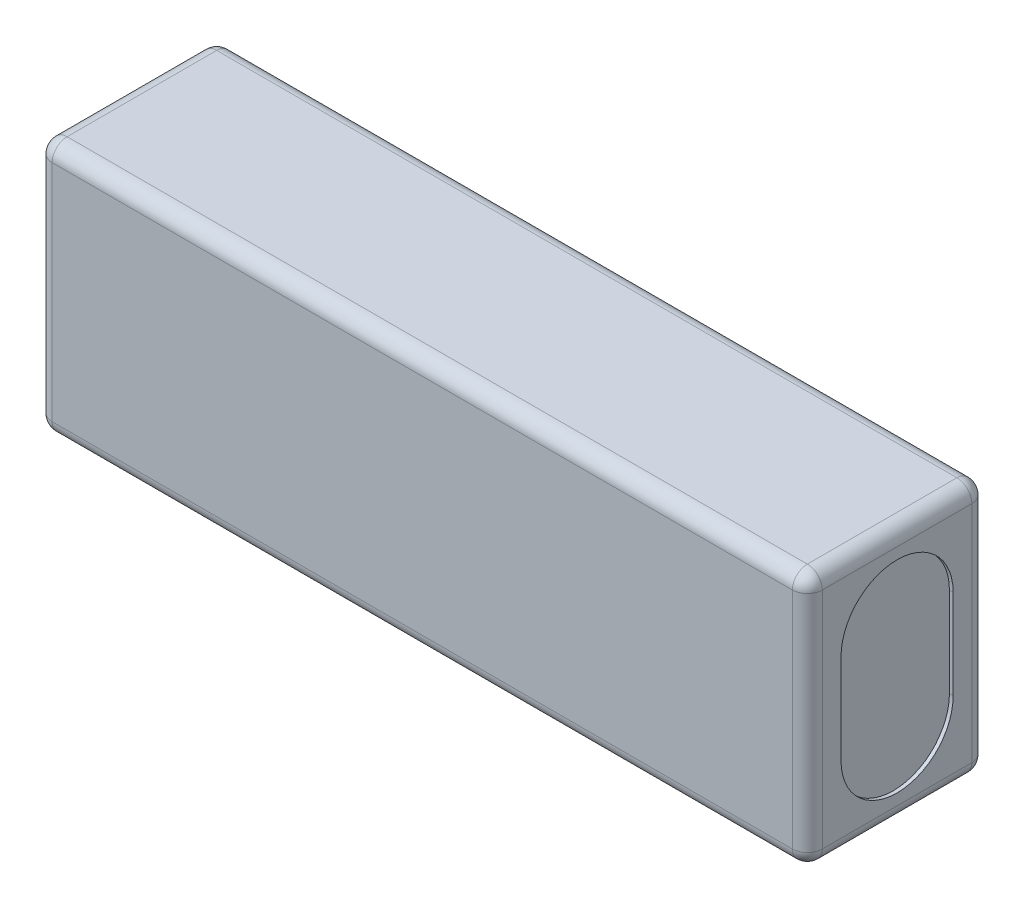
ISO-10303-21;
HEADER;
FILE_DESCRIPTION(('STEP AP214'),'2;1');
FILE_NAME('part.step','',(''),(''),'','','');
FILE_SCHEMA(('AUTOMOTIVE_DESIGN { 1 0 10303 214 1 1 1 1 }'));
ENDSEC;
DATA;
#1=APPLICATION_CONTEXT('core data for automotive mechanical design processes');
#2=APPLICATION_PROTOCOL_DEFINITION('international standard','automotive_design',2000,#1);
#3=PRODUCT_CONTEXT('',#1,'mechanical');
#4=PRODUCT('Part','Part','',(#3));
#5=PRODUCT_RELATED_PRODUCT_CATEGORY('part','',(#4));
#6=PRODUCT_DEFINITION_FORMATION('','',#4);
#7=PRODUCT_DEFINITION_CONTEXT('part definition',#1,'design');
#8=PRODUCT_DEFINITION('design','',#6,#7);
#9=PRODUCT_DEFINITION_SHAPE('','',#8);
#10=(LENGTH_UNIT() NAMED_UNIT(*) SI_UNIT(.MILLI.,.METRE.));
#11=(NAMED_UNIT(*) PLANE_ANGLE_UNIT() SI_UNIT($,.RADIAN.));
#12=(NAMED_UNIT(*) SI_UNIT($,.STERADIAN.) SOLID_ANGLE_UNIT());
#13=UNCERTAINTY_MEASURE_WITH_UNIT(LENGTH_MEASURE(1.E-05),#10,'distance_accuracy_value','');
#14=(GEOMETRIC_REPRESENTATION_CONTEXT(3) GLOBAL_UNCERTAINTY_ASSIGNED_CONTEXT((#13)) GLOBAL_UNIT_ASSIGNED_CONTEXT((#10,
#11,#12)) REPRESENTATION_CONTEXT('',''));
#15=CARTESIAN_POINT('',(0.,0.,0.));
#16=DIRECTION('',(0.,0.,1.));
#17=DIRECTION('',(1.,0.,0.));
#18=AXIS2_PLACEMENT_3D('',#15,#16,#17);
#19=CARTESIAN_POINT('',(-51.5,17.,24.));
#20=DIRECTION('',(1.,0.,0.));
#21=DIRECTION('',(0.,1.,0.));
#22=AXIS2_PLACEMENT_3D('',#19,#20,#21);
#23=PLANE('',#22);
#24=DIRECTION('',(0.,-1.,0.));
#25=VECTOR('',#24,1.);
#26=CARTESIAN_POINT('',(-51.5,17.,2.));
#27=LINE('',#26,#25);
#28=CARTESIAN_POINT('',(-51.5,15.,2.));
#29=VERTEX_POINT('',#28);
#30=CARTESIAN_POINT('',(-51.5,-15.,2.));
#31=VERTEX_POINT('',#30);
#32=EDGE_CURVE('E258',#29,#31,#27,.T.);
#33=ORIENTED_EDGE('',*,*,#32,.T.);
#34=DIRECTION('',(0.,0.,-1.));
#35=VECTOR('',#34,1.);
#36=CARTESIAN_POINT('',(-51.5,-15.,24.));
#37=LINE('',#36,#35);
#38=CARTESIAN_POINT('',(-51.5,-15.,22.));
#39=VERTEX_POINT('',#38);
#40=EDGE_CURVE('E260',#31,#39,#37,.F.);
#41=ORIENTED_EDGE('',*,*,#40,.T.);
#42=DIRECTION('',(0.,-1.,0.));
#43=VECTOR('',#42,1.);
#44=CARTESIAN_POINT('',(-51.5,17.,22.));
#45=LINE('',#44,#43);
#46=CARTESIAN_POINT('',(-51.5,15.,22.));
#47=VERTEX_POINT('',#46);
#48=EDGE_CURVE('E254',#39,#47,#45,.F.);
#49=ORIENTED_EDGE('',*,*,#48,.T.);
#50=DIRECTION('',(0.,0.,-1.));
#51=VECTOR('',#50,1.);
#52=CARTESIAN_POINT('',(-51.5,15.,24.));
#53=LINE('',#52,#51);
#54=EDGE_CURVE('E256',#47,#29,#53,.T.);
#55=ORIENTED_EDGE('',*,*,#54,.T.);
#56=EDGE_LOOP('',(#33,#41,#49,#55));
#57=FACE_BOUND('',#56,.T.);
#58=CARTESIAN_POINT('',(-51.5,6.,12.));
#59=DIRECTION('',(1.,0.,0.));
#60=DIRECTION('',(0.,1.,0.));
#61=AXIS2_PLACEMENT_3D('',#58,#59,#60);
#62=CIRCLE('',#61,7.5);
#63=CARTESIAN_POINT('',(-51.5,6.00000000000001,4.5));
#64=VERTEX_POINT('',#63);
#65=CARTESIAN_POINT('',(-51.5,6.,19.5));
#66=VERTEX_POINT('',#65);
#67=EDGE_CURVE('E191',#64,#66,#62,.T.);
#68=ORIENTED_EDGE('',*,*,#67,.T.);
#69=DIRECTION('',(0.,-1.,0.));
#70=VECTOR('',#69,1.);
#71=CARTESIAN_POINT('',(-51.5,6.,19.5));
#72=LINE('',#71,#70);
#73=CARTESIAN_POINT('',(-51.5,-6.,19.5));
#74=VERTEX_POINT('',#73);
#75=EDGE_CURVE('E195',#66,#74,#72,.T.);
#76=ORIENTED_EDGE('',*,*,#75,.T.);
#77=CARTESIAN_POINT('',(-51.5,-6.,12.));
#78=DIRECTION('',(1.,0.,0.));
#79=DIRECTION('',(0.,1.,0.));
#80=AXIS2_PLACEMENT_3D('',#77,#78,#79);
#81=CIRCLE('',#80,7.5);
#82=CARTESIAN_POINT('',(-51.5,-6.,4.5));
#83=VERTEX_POINT('',#82);
#84=EDGE_CURVE('E198',#74,#83,#81,.T.);
#85=ORIENTED_EDGE('',*,*,#84,.T.);
#86=DIRECTION('',(0.,1.,0.));
#87=VECTOR('',#86,1.);
#88=CARTESIAN_POINT('',(-51.5,6.00000000000001,4.5));
#89=LINE('',#88,#87);
#90=EDGE_CURVE('E204',#83,#64,#89,.T.);
#91=ORIENTED_EDGE('',*,*,#90,.T.);
#92=EDGE_LOOP('',(#68,#76,#85,#91));
#93=FACE_BOUND('',#92,.T.);
#94=ADVANCED_FACE('F34',(#57,#93),#23,.F.);
#95=CARTESIAN_POINT('',(51.5,17.,24.));
#96=DIRECTION('',(-1.,0.,0.));
#97=DIRECTION('',(0.,-1.,0.));
#98=AXIS2_PLACEMENT_3D('',#95,#96,#97);
#99=PLANE('',#98);
#100=DIRECTION('',(0.,1.,0.));
#101=VECTOR('',#100,1.);
#102=CARTESIAN_POINT('',(51.5,-17.,22.));
#103=LINE('',#102,#101);
#104=CARTESIAN_POINT('',(51.5,15.,22.));
#105=VERTEX_POINT('',#104);
#106=CARTESIAN_POINT('',(51.5,-15.,22.));
#107=VERTEX_POINT('',#106);
#108=EDGE_CURVE('E263',#105,#107,#103,.F.);
#109=ORIENTED_EDGE('',*,*,#108,.T.);
#110=DIRECTION('',(0.,0.,-1.));
#111=VECTOR('',#110,1.);
#112=CARTESIAN_POINT('',(51.5,-15.,24.));
#113=LINE('',#112,#111);
#114=CARTESIAN_POINT('',(51.5,-15.,2.));
#115=VERTEX_POINT('',#114);
#116=EDGE_CURVE('E269',#107,#115,#113,.T.);
#117=ORIENTED_EDGE('',*,*,#116,.T.);
#118=DIRECTION('',(0.,1.,0.));
#119=VECTOR('',#118,1.);
#120=CARTESIAN_POINT('',(51.5,17.,2.));
#121=LINE('',#120,#119);
#122=CARTESIAN_POINT('',(51.5,15.,2.));
#123=VERTEX_POINT('',#122);
#124=EDGE_CURVE('E267',#115,#123,#121,.T.);
#125=ORIENTED_EDGE('',*,*,#124,.T.);
#126=DIRECTION('',(0.,0.,-1.));
#127=VECTOR('',#126,1.);
#128=CARTESIAN_POINT('',(51.5,15.,24.));
#129=LINE('',#128,#127);
#130=EDGE_CURVE('E265',#123,#105,#129,.F.);
#131=ORIENTED_EDGE('',*,*,#130,.T.);
#132=EDGE_LOOP('',(#109,#117,#125,#131));
#133=FACE_BOUND('',#132,.T.);
#134=DIRECTION('',(0.,-1.,0.));
#135=VECTOR('',#134,1.);
#136=CARTESIAN_POINT('',(51.5,6.,19.5));
#137=LINE('',#136,#135);
#138=CARTESIAN_POINT('',(51.5,6.,19.5));
#139=VERTEX_POINT('',#138);
#140=CARTESIAN_POINT('',(51.5,-6.,19.5));
#141=VERTEX_POINT('',#140);
#142=EDGE_CURVE('E229',#139,#141,#137,.T.);
#143=ORIENTED_EDGE('',*,*,#142,.F.);
#144=CARTESIAN_POINT('',(51.5,6.,12.));
#145=DIRECTION('',(1.,0.,0.));
#146=DIRECTION('',(0.,1.,0.));
#147=AXIS2_PLACEMENT_3D('',#144,#145,#146);
#148=CIRCLE('',#147,7.5);
#149=CARTESIAN_POINT('',(51.5,6.00000000000001,4.5));
#150=VERTEX_POINT('',#149);
#151=EDGE_CURVE('E210',#150,#139,#148,.T.);
#152=ORIENTED_EDGE('',*,*,#151,.F.);
#153=DIRECTION('',(0.,1.,0.));
#154=VECTOR('',#153,1.);
#155=CARTESIAN_POINT('',(51.5,6.00000000000001,4.5));
#156=LINE('',#155,#154);
#157=CARTESIAN_POINT('',(51.5,-6.,4.5));
#158=VERTEX_POINT('',#157);
#159=EDGE_CURVE('E218',#158,#150,#156,.T.);
#160=ORIENTED_EDGE('',*,*,#159,.F.);
#161=CARTESIAN_POINT('',(51.5,-6.,12.));
#162=DIRECTION('',(1.,0.,0.));
#163=DIRECTION('',(0.,1.,0.));
#164=AXIS2_PLACEMENT_3D('',#161,#162,#163);
#165=CIRCLE('',#164,7.5);
#166=EDGE_CURVE('E232',#141,#158,#165,.T.);
#167=ORIENTED_EDGE('',*,*,#166,.F.);
#168=EDGE_LOOP('',(#143,#152,#160,#167));
#169=FACE_BOUND('',#168,.T.);
#170=ADVANCED_FACE('F397',(#133,#169),#99,.F.);
#171=CARTESIAN_POINT('',(-51.5,17.,24.));
#172=DIRECTION('',(0.,-1.,0.));
#173=DIRECTION('',(0.,0.,-1.));
#174=AXIS2_PLACEMENT_3D('',#171,#172,#173);
#175=PLANE('',#174);
#176=DIRECTION('',(0.,0.,-1.));
#177=VECTOR('',#176,1.);
#178=CARTESIAN_POINT('',(49.5,17.,24.));
#179=LINE('',#178,#177);
#180=CARTESIAN_POINT('',(49.5,17.,22.));
#181=VERTEX_POINT('',#180);
#182=CARTESIAN_POINT('',(49.5,17.,2.));
#183=VERTEX_POINT('',#182);
#184=EDGE_CURVE('E285',#181,#183,#179,.T.);
#185=ORIENTED_EDGE('',*,*,#184,.T.);
#186=DIRECTION('',(-1.,0.,0.));
#187=VECTOR('',#186,1.);
#188=CARTESIAN_POINT('',(-51.5,17.,2.));
#189=LINE('',#188,#187);
#190=CARTESIAN_POINT('',(-49.5,17.,2.));
#191=VERTEX_POINT('',#190);
#192=EDGE_CURVE('E288',#183,#191,#189,.T.);
#193=ORIENTED_EDGE('',*,*,#192,.T.);
#194=DIRECTION('',(0.,0.,-1.));
#195=VECTOR('',#194,1.);
#196=CARTESIAN_POINT('',(-49.5,17.,24.));
#197=LINE('',#196,#195);
#198=CARTESIAN_POINT('',(-49.5,17.,22.));
#199=VERTEX_POINT('',#198);
#200=EDGE_CURVE('E283',#191,#199,#197,.F.);
#201=ORIENTED_EDGE('',*,*,#200,.T.);
#202=DIRECTION('',(-1.,0.,0.));
#203=VECTOR('',#202,1.);
#204=CARTESIAN_POINT('',(51.5,17.,22.));
#205=LINE('',#204,#203);
#206=EDGE_CURVE('E281',#199,#181,#205,.F.);
#207=ORIENTED_EDGE('',*,*,#206,.T.);
#208=EDGE_LOOP('',(#185,#193,#201,#207));
#209=FACE_BOUND('',#208,.T.);
#210=ADVANCED_FACE('F412',(#209),#175,.F.);
#211=CARTESIAN_POINT('',(-51.5,-17.,24.));
#212=DIRECTION('',(0.,1.,0.));
#213=DIRECTION('',(0.,0.,1.));
#214=AXIS2_PLACEMENT_3D('',#211,#212,#213);
#215=PLANE('',#214);
#216=DIRECTION('',(0.,0.,-1.));
#217=VECTOR('',#216,1.);
#218=CARTESIAN_POINT('',(-49.5,-17.,24.));
#219=LINE('',#218,#217);
#220=CARTESIAN_POINT('',(-49.5,-17.,22.));
#221=VERTEX_POINT('',#220);
#222=CARTESIAN_POINT('',(-49.5,-17.,2.));
#223=VERTEX_POINT('',#222);
#224=EDGE_CURVE('E249',#221,#223,#219,.T.);
#225=ORIENTED_EDGE('',*,*,#224,.T.);
#226=DIRECTION('',(1.,0.,0.));
#227=VECTOR('',#226,1.);
#228=CARTESIAN_POINT('',(-51.5,-17.,2.));
#229=LINE('',#228,#227);
#230=CARTESIAN_POINT('',(49.5,-17.,2.));
#231=VERTEX_POINT('',#230);
#232=EDGE_CURVE('E252',#223,#231,#229,.T.);
#233=ORIENTED_EDGE('',*,*,#232,.T.);
#234=DIRECTION('',(0.,0.,-1.));
#235=VECTOR('',#234,1.);
#236=CARTESIAN_POINT('',(49.5,-17.,24.));
#237=LINE('',#236,#235);
#238=CARTESIAN_POINT('',(49.5,-17.,22.));
#239=VERTEX_POINT('',#238);
#240=EDGE_CURVE('E247',#231,#239,#237,.F.);
#241=ORIENTED_EDGE('',*,*,#240,.T.);
#242=DIRECTION('',(1.,0.,0.));
#243=VECTOR('',#242,1.);
#244=CARTESIAN_POINT('',(-51.5,-17.,22.));
#245=LINE('',#244,#243);
#246=EDGE_CURVE('E239',#239,#221,#245,.F.);
#247=ORIENTED_EDGE('',*,*,#246,.T.);
#248=EDGE_LOOP('',(#225,#233,#241,#247));
#249=FACE_BOUND('',#248,.T.);
#250=ADVANCED_FACE('F444',(#249),#215,.F.);
#251=CARTESIAN_POINT('',(0.,0.,24.));
#252=DIRECTION('',(0.,0.,1.));
#253=DIRECTION('',(1.,0.,0.));
#254=AXIS2_PLACEMENT_3D('',#251,#252,#253);
#255=PLANE('',#254);
#256=DIRECTION('',(0.,-1.,0.));
#257=VECTOR('',#256,1.);
#258=CARTESIAN_POINT('',(-49.5,-17.,24.));
#259=LINE('',#258,#257);
#260=CARTESIAN_POINT('',(-49.5,15.,24.));
#261=VERTEX_POINT('',#260);
#262=CARTESIAN_POINT('',(-49.5,-15.,24.));
#263=VERTEX_POINT('',#262);
#264=EDGE_CURVE('E43',#261,#263,#259,.T.);
#265=ORIENTED_EDGE('',*,*,#264,.T.);
#266=DIRECTION('',(1.,0.,0.));
#267=VECTOR('',#266,1.);
#268=CARTESIAN_POINT('',(51.5,-15.,24.));
#269=LINE('',#268,#267);
#270=CARTESIAN_POINT('',(49.5,-15.,24.));
#271=VERTEX_POINT('',#270);
#272=EDGE_CURVE('E11',#263,#271,#269,.T.);
#273=ORIENTED_EDGE('',*,*,#272,.T.);
#274=DIRECTION('',(0.,1.,0.));
#275=VECTOR('',#274,1.);
#276=CARTESIAN_POINT('',(49.5,17.,24.));
#277=LINE('',#276,#275);
#278=CARTESIAN_POINT('',(49.5,15.,24.));
#279=VERTEX_POINT('',#278);
#280=EDGE_CURVE('E290',#271,#279,#277,.T.);
#281=ORIENTED_EDGE('',*,*,#280,.T.);
#282=DIRECTION('',(-1.,0.,0.));
#283=VECTOR('',#282,1.);
#284=CARTESIAN_POINT('',(-51.5,15.,24.));
#285=LINE('',#284,#283);
#286=EDGE_CURVE('E54',#279,#261,#285,.T.);
#287=ORIENTED_EDGE('',*,*,#286,.T.);
#288=EDGE_LOOP('',(#265,#273,#281,#287));
#289=FACE_BOUND('',#288,.T.);
#290=ADVANCED_FACE('F390',(#289),#255,.T.);
#291=CARTESIAN_POINT('',(0.,0.,0.));
#292=DIRECTION('',(0.,0.,1.));
#293=DIRECTION('',(1.,0.,0.));
#294=AXIS2_PLACEMENT_3D('',#291,#292,#293);
#295=PLANE('',#294);
#296=DIRECTION('',(1.,0.,0.));
#297=VECTOR('',#296,1.);
#298=CARTESIAN_POINT('',(0.,-15.,0.));
#299=LINE('',#298,#297);
#300=CARTESIAN_POINT('',(49.5,-15.,0.));
#301=VERTEX_POINT('',#300);
#302=CARTESIAN_POINT('',(-49.5,-15.,0.));
#303=VERTEX_POINT('',#302);
#304=EDGE_CURVE('E276',#301,#303,#299,.F.);
#305=ORIENTED_EDGE('',*,*,#304,.T.);
#306=DIRECTION('',(0.,-1.,0.));
#307=VECTOR('',#306,1.);
#308=CARTESIAN_POINT('',(-49.5,0.,0.));
#309=LINE('',#308,#307);
#310=CARTESIAN_POINT('',(-49.5,15.,0.));
#311=VERTEX_POINT('',#310);
#312=EDGE_CURVE('E278',#303,#311,#309,.F.);
#313=ORIENTED_EDGE('',*,*,#312,.T.);
#314=DIRECTION('',(-1.,0.,0.));
#315=VECTOR('',#314,1.);
#316=CARTESIAN_POINT('',(0.,15.,0.));
#317=LINE('',#316,#315);
#318=CARTESIAN_POINT('',(49.5,15.,0.));
#319=VERTEX_POINT('',#318);
#320=EDGE_CURVE('E272',#311,#319,#317,.F.);
#321=ORIENTED_EDGE('',*,*,#320,.T.);
#322=DIRECTION('',(0.,1.,0.));
#323=VECTOR('',#322,1.);
#324=CARTESIAN_POINT('',(49.5,0.,0.));
#325=LINE('',#324,#323);
#326=EDGE_CURVE('E274',#319,#301,#325,.F.);
#327=ORIENTED_EDGE('',*,*,#326,.T.);
#328=EDGE_LOOP('',(#305,#313,#321,#327));
#329=FACE_BOUND('',#328,.T.);
#330=ADVANCED_FACE('F451',(#329),#295,.F.);
#331=CARTESIAN_POINT('',(51.,6.,12.));
#332=DIRECTION('',(1.,0.,0.));
#333=DIRECTION('',(0.,1.,0.));
#334=AXIS2_PLACEMENT_3D('',#331,#332,#333);
#335=CYLINDRICAL_SURFACE('',#334,7.5);
#336=ORIENTED_EDGE('',*,*,#151,.T.);
#337=DIRECTION('',(1.,0.,0.));
#338=VECTOR('',#337,1.);
#339=CARTESIAN_POINT('',(51.,6.,19.5));
#340=LINE('',#339,#338);
#341=CARTESIAN_POINT('',(51.,6.,19.5));
#342=VERTEX_POINT('',#341);
#343=EDGE_CURVE('E227',#342,#139,#340,.T.);
#344=ORIENTED_EDGE('',*,*,#343,.F.);
#345=CARTESIAN_POINT('',(51.,6.,12.));
#346=DIRECTION('',(1.,0.,0.));
#347=DIRECTION('',(0.,1.,0.));
#348=AXIS2_PLACEMENT_3D('',#345,#346,#347);
#349=CIRCLE('',#348,7.5);
#350=CARTESIAN_POINT('',(51.,6.00000000000001,4.5));
#351=VERTEX_POINT('',#350);
#352=EDGE_CURVE('E214',#351,#342,#349,.T.);
#353=ORIENTED_EDGE('',*,*,#352,.F.);
#354=DIRECTION('',(1.,0.,0.));
#355=VECTOR('',#354,1.);
#356=CARTESIAN_POINT('',(51.,6.00000000000001,4.5));
#357=LINE('',#356,#355);
#358=EDGE_CURVE('E237',#351,#150,#357,.T.);
#359=ORIENTED_EDGE('',*,*,#358,.T.);
#360=EDGE_LOOP('',(#336,#344,#353,#359));
#361=FACE_BOUND('',#360,.T.);
#362=ADVANCED_FACE('F533',(#361),#335,.F.);
#363=CARTESIAN_POINT('',(51.,6.00000000000001,4.5));
#364=DIRECTION('',(0.,0.,-1.));
#365=DIRECTION('',(0.,1.,0.));
#366=AXIS2_PLACEMENT_3D('',#363,#364,#365);
#367=PLANE('',#366);
#368=ORIENTED_EDGE('',*,*,#159,.T.);
#369=ORIENTED_EDGE('',*,*,#358,.F.);
#370=DIRECTION('',(0.,1.,0.));
#371=VECTOR('',#370,1.);
#372=CARTESIAN_POINT('',(51.,6.00000000000001,4.5));
#373=LINE('',#372,#371);
#374=CARTESIAN_POINT('',(51.,-6.,4.5));
#375=VERTEX_POINT('',#374);
#376=EDGE_CURVE('E224',#375,#351,#373,.T.);
#377=ORIENTED_EDGE('',*,*,#376,.F.);
#378=DIRECTION('',(1.,0.,0.));
#379=VECTOR('',#378,1.);
#380=CARTESIAN_POINT('',(51.,-6.,4.5));
#381=LINE('',#380,#379);
#382=EDGE_CURVE('E240',#375,#158,#381,.T.);
#383=ORIENTED_EDGE('',*,*,#382,.T.);
#384=EDGE_LOOP('',(#368,#369,#377,#383));
#385=FACE_BOUND('',#384,.T.);
#386=ADVANCED_FACE('F529',(#385),#367,.F.);
#387=CARTESIAN_POINT('',(51.,-6.,12.));
#388=DIRECTION('',(1.,0.,0.));
#389=DIRECTION('',(0.,1.,0.));
#390=AXIS2_PLACEMENT_3D('',#387,#388,#389);
#391=CYLINDRICAL_SURFACE('',#390,7.5);
#392=ORIENTED_EDGE('',*,*,#166,.T.);
#393=ORIENTED_EDGE('',*,*,#382,.F.);
#394=CARTESIAN_POINT('',(51.,-6.,12.));
#395=DIRECTION('',(1.,0.,0.));
#396=DIRECTION('',(0.,1.,0.));
#397=AXIS2_PLACEMENT_3D('',#394,#395,#396);
#398=CIRCLE('',#397,7.5);
#399=CARTESIAN_POINT('',(51.,-6.,19.5));
#400=VERTEX_POINT('',#399);
#401=EDGE_CURVE('E221',#400,#375,#398,.T.);
#402=ORIENTED_EDGE('',*,*,#401,.F.);
#403=DIRECTION('',(1.,0.,0.));
#404=VECTOR('',#403,1.);
#405=CARTESIAN_POINT('',(51.,-6.,19.5));
#406=LINE('',#405,#404);
#407=EDGE_CURVE('E242',#400,#141,#406,.T.);
#408=ORIENTED_EDGE('',*,*,#407,.T.);
#409=EDGE_LOOP('',(#392,#393,#402,#408));
#410=FACE_BOUND('',#409,.T.);
#411=ADVANCED_FACE('F532',(#410),#391,.F.);
#412=CARTESIAN_POINT('',(51.,6.,19.5));
#413=DIRECTION('',(0.,0.,1.));
#414=DIRECTION('',(0.,-1.,0.));
#415=AXIS2_PLACEMENT_3D('',#412,#413,#414);
#416=PLANE('',#415);
#417=ORIENTED_EDGE('',*,*,#142,.T.);
#418=ORIENTED_EDGE('',*,*,#407,.F.);
#419=DIRECTION('',(0.,-1.,0.));
#420=VECTOR('',#419,1.);
#421=CARTESIAN_POINT('',(51.,6.,19.5));
#422=LINE('',#421,#420);
#423=EDGE_CURVE('E217',#342,#400,#422,.T.);
#424=ORIENTED_EDGE('',*,*,#423,.F.);
#425=ORIENTED_EDGE('',*,*,#343,.T.);
#426=EDGE_LOOP('',(#417,#418,#424,#425));
#427=FACE_BOUND('',#426,.T.);
#428=ADVANCED_FACE('F527',(#427),#416,.F.);
#429=CARTESIAN_POINT('',(51.,6.,12.));
#430=DIRECTION('',(1.,0.,0.));
#431=DIRECTION('',(0.,1.,0.));
#432=AXIS2_PLACEMENT_3D('',#429,#430,#431);
#433=PLANE('',#432);
#434=ORIENTED_EDGE('',*,*,#352,.T.);
#435=ORIENTED_EDGE('',*,*,#423,.T.);
#436=ORIENTED_EDGE('',*,*,#401,.T.);
#437=ORIENTED_EDGE('',*,*,#376,.T.);
#438=EDGE_LOOP('',(#434,#435,#436,#437));
#439=FACE_BOUND('',#438,.T.);
#440=ADVANCED_FACE('F524',(#439),#433,.T.);
#441=CARTESIAN_POINT('',(-51.,6.,12.));
#442=DIRECTION('',(-1.,0.,0.));
#443=DIRECTION('',(0.,-1.,0.));
#444=AXIS2_PLACEMENT_3D('',#441,#442,#443);
#445=CYLINDRICAL_SURFACE('',#444,7.5);
#446=ORIENTED_EDGE('',*,*,#67,.F.);
#447=DIRECTION('',(-1.,0.,0.));
#448=VECTOR('',#447,1.);
#449=CARTESIAN_POINT('',(-51.,6.00000000000001,4.5));
#450=LINE('',#449,#448);
#451=CARTESIAN_POINT('',(-51.,6.00000000000001,4.5));
#452=VERTEX_POINT('',#451);
#453=EDGE_CURVE('E176',#452,#64,#450,.T.);
#454=ORIENTED_EDGE('',*,*,#453,.F.);
#455=CARTESIAN_POINT('',(-51.,6.,12.));
#456=DIRECTION('',(1.,0.,0.));
#457=DIRECTION('',(0.,1.,0.));
#458=AXIS2_PLACEMENT_3D('',#455,#456,#457);
#459=CIRCLE('',#458,7.5);
#460=CARTESIAN_POINT('',(-51.,6.,19.5));
#461=VERTEX_POINT('',#460);
#462=EDGE_CURVE('E183',#452,#461,#459,.T.);
#463=ORIENTED_EDGE('',*,*,#462,.T.);
#464=DIRECTION('',(-1.,0.,0.));
#465=VECTOR('',#464,1.);
#466=CARTESIAN_POINT('',(-51.,6.,19.5));
#467=LINE('',#466,#465);
#468=EDGE_CURVE('E208',#461,#66,#467,.T.);
#469=ORIENTED_EDGE('',*,*,#468,.T.);
#470=EDGE_LOOP('',(#446,#454,#463,#469));
#471=FACE_BOUND('',#470,.T.);
#472=ADVANCED_FACE('F187',(#471),#445,.F.);
#473=CARTESIAN_POINT('',(-51.,6.,19.5));
#474=DIRECTION('',(0.,0.,-1.));
#475=DIRECTION('',(0.,1.,0.));
#476=AXIS2_PLACEMENT_3D('',#473,#474,#475);
#477=PLANE('',#476);
#478=ORIENTED_EDGE('',*,*,#75,.F.);
#479=ORIENTED_EDGE('',*,*,#468,.F.);
#480=DIRECTION('',(0.,-1.,0.));
#481=VECTOR('',#480,1.);
#482=CARTESIAN_POINT('',(-51.,6.,19.5));
#483=LINE('',#482,#481);
#484=CARTESIAN_POINT('',(-51.,-6.,19.5));
#485=VERTEX_POINT('',#484);
#486=EDGE_CURVE('E192',#461,#485,#483,.T.);
#487=ORIENTED_EDGE('',*,*,#486,.T.);
#488=DIRECTION('',(-1.,0.,0.));
#489=VECTOR('',#488,1.);
#490=CARTESIAN_POINT('',(-51.,-6.,19.5));
#491=LINE('',#490,#489);
#492=EDGE_CURVE('E211',#485,#74,#491,.T.);
#493=ORIENTED_EDGE('',*,*,#492,.T.);
#494=EDGE_LOOP('',(#478,#479,#487,#493));
#495=FACE_BOUND('',#494,.T.);
#496=ADVANCED_FACE('F515',(#495),#477,.T.);
#497=CARTESIAN_POINT('',(-51.,-6.,12.));
#498=DIRECTION('',(-1.,0.,0.));
#499=DIRECTION('',(0.,-1.,0.));
#500=AXIS2_PLACEMENT_3D('',#497,#498,#499);
#501=CYLINDRICAL_SURFACE('',#500,7.5);
#502=ORIENTED_EDGE('',*,*,#84,.F.);
#503=ORIENTED_EDGE('',*,*,#492,.F.);
#504=CARTESIAN_POINT('',(-51.,-6.,12.));
#505=DIRECTION('',(1.,0.,0.));
#506=DIRECTION('',(0.,1.,0.));
#507=AXIS2_PLACEMENT_3D('',#504,#505,#506);
#508=CIRCLE('',#507,7.5);
#509=CARTESIAN_POINT('',(-51.,-6.,4.5));
#510=VERTEX_POINT('',#509);
#511=EDGE_CURVE('E182',#485,#510,#508,.T.);
#512=ORIENTED_EDGE('',*,*,#511,.T.);
#513=DIRECTION('',(-1.,0.,0.));
#514=VECTOR('',#513,1.);
#515=CARTESIAN_POINT('',(-51.,-6.,4.5));
#516=LINE('',#515,#514);
#517=EDGE_CURVE('E178',#510,#83,#516,.T.);
#518=ORIENTED_EDGE('',*,*,#517,.T.);
#519=EDGE_LOOP('',(#502,#503,#512,#518));
#520=FACE_BOUND('',#519,.T.);
#521=ADVANCED_FACE('F512',(#520),#501,.F.);
#522=CARTESIAN_POINT('',(-51.,6.00000000000001,4.5));
#523=DIRECTION('',(0.,0.,1.));
#524=DIRECTION('',(0.,-1.,0.));
#525=AXIS2_PLACEMENT_3D('',#522,#523,#524);
#526=PLANE('',#525);
#527=ORIENTED_EDGE('',*,*,#90,.F.);
#528=ORIENTED_EDGE('',*,*,#517,.F.);
#529=DIRECTION('',(0.,1.,0.));
#530=VECTOR('',#529,1.);
#531=CARTESIAN_POINT('',(-51.,6.00000000000001,4.5));
#532=LINE('',#531,#530);
#533=EDGE_CURVE('E172',#510,#452,#532,.T.);
#534=ORIENTED_EDGE('',*,*,#533,.T.);
#535=ORIENTED_EDGE('',*,*,#453,.T.);
#536=EDGE_LOOP('',(#527,#528,#534,#535));
#537=FACE_BOUND('',#536,.T.);
#538=ADVANCED_FACE('F175',(#537),#526,.T.);
#539=CARTESIAN_POINT('',(-51.,6.,12.));
#540=DIRECTION('',(-1.,0.,0.));
#541=DIRECTION('',(0.,1.,0.));
#542=AXIS2_PLACEMENT_3D('',#539,#540,#541);
#543=PLANE('',#542);
#544=ORIENTED_EDGE('',*,*,#462,.F.);
#545=ORIENTED_EDGE('',*,*,#533,.F.);
#546=ORIENTED_EDGE('',*,*,#511,.F.);
#547=ORIENTED_EDGE('',*,*,#486,.F.);
#548=EDGE_LOOP('',(#544,#545,#546,#547));
#549=FACE_BOUND('',#548,.T.);
#550=ADVANCED_FACE('F194',(#549),#543,.T.);
#551=CARTESIAN_POINT('',(49.5,15.,24.));
#552=DIRECTION('',(0.,0.,-1.));
#553=DIRECTION('',(-1.,0.,0.));
#554=AXIS2_PLACEMENT_3D('',#551,#552,#553);
#555=CYLINDRICAL_SURFACE('',#554,2.);
#556=CARTESIAN_POINT('',(49.5,15.,22.));
#557=DIRECTION('',(0.,0.,1.));
#558=DIRECTION('',(1.,0.,0.));
#559=AXIS2_PLACEMENT_3D('',#556,#557,#558);
#560=CIRCLE('',#559,2.);
#561=EDGE_CURVE('E38',#105,#181,#560,.T.);
#562=ORIENTED_EDGE('',*,*,#561,.F.);
#563=ORIENTED_EDGE('',*,*,#130,.F.);
#564=CARTESIAN_POINT('',(49.5,15.,2.));
#565=DIRECTION('',(0.,0.,-1.));
#566=DIRECTION('',(-1.,0.,0.));
#567=AXIS2_PLACEMENT_3D('',#564,#565,#566);
#568=CIRCLE('',#567,2.);
#569=EDGE_CURVE('E354',#183,#123,#568,.T.);
#570=ORIENTED_EDGE('',*,*,#569,.F.);
#571=ORIENTED_EDGE('',*,*,#184,.F.);
#572=EDGE_LOOP('',(#562,#563,#570,#571));
#573=FACE_BOUND('',#572,.T.);
#574=ADVANCED_FACE('F36',(#573),#555,.T.);
#575=CARTESIAN_POINT('',(49.5,15.,22.));
#576=DIRECTION('',(0.,0.,1.));
#577=DIRECTION('',(1.,0.,0.));
#578=AXIS2_PLACEMENT_3D('',#575,#576,#577);
#579=SPHERICAL_SURFACE('',#578,2.);
#580=CARTESIAN_POINT('',(49.5,15.,22.));
#581=DIRECTION('',(0.,1.,0.));
#582=DIRECTION('',(0.,0.,1.));
#583=AXIS2_PLACEMENT_3D('',#580,#581,#582);
#584=CIRCLE('',#583,2.);
#585=EDGE_CURVE('E349',#105,#279,#584,.F.);
#586=ORIENTED_EDGE('',*,*,#585,.F.);
#587=ORIENTED_EDGE('',*,*,#561,.T.);
#588=CARTESIAN_POINT('',(49.5,15.,22.));
#589=DIRECTION('',(1.,0.,0.));
#590=DIRECTION('',(0.,0.,-1.));
#591=AXIS2_PLACEMENT_3D('',#588,#589,#590);
#592=CIRCLE('',#591,2.);
#593=EDGE_CURVE('E352',#279,#181,#592,.F.);
#594=ORIENTED_EDGE('',*,*,#593,.F.);
#595=EDGE_LOOP('',(#586,#587,#594));
#596=FACE_BOUND('',#595,.T.);
#597=ADVANCED_FACE('F365',(#596),#579,.T.);
#598=CARTESIAN_POINT('',(49.5,15.,2.));
#599=DIRECTION('',(0.,0.,1.));
#600=DIRECTION('',(1.,0.,0.));
#601=AXIS2_PLACEMENT_3D('',#598,#599,#600);
#602=SPHERICAL_SURFACE('',#601,2.);
#603=CARTESIAN_POINT('',(49.5,15.,2.));
#604=DIRECTION('',(1.,0.,0.));
#605=DIRECTION('',(0.,0.,-1.));
#606=AXIS2_PLACEMENT_3D('',#603,#604,#605);
#607=CIRCLE('',#606,2.);
#608=EDGE_CURVE('E343',#183,#319,#607,.F.);
#609=ORIENTED_EDGE('',*,*,#608,.F.);
#610=ORIENTED_EDGE('',*,*,#569,.T.);
#611=CARTESIAN_POINT('',(49.5,15.,2.));
#612=DIRECTION('',(0.,1.,0.));
#613=DIRECTION('',(0.,0.,1.));
#614=AXIS2_PLACEMENT_3D('',#611,#612,#613);
#615=CIRCLE('',#614,2.);
#616=EDGE_CURVE('E346',#319,#123,#615,.F.);
#617=ORIENTED_EDGE('',*,*,#616,.F.);
#618=EDGE_LOOP('',(#609,#610,#617));
#619=FACE_BOUND('',#618,.T.);
#620=ADVANCED_FACE('F499',(#619),#602,.T.);
#621=CARTESIAN_POINT('',(0.,15.,22.));
#622=DIRECTION('',(1.,0.,0.));
#623=DIRECTION('',(0.,0.,-1.));
#624=AXIS2_PLACEMENT_3D('',#621,#622,#623);
#625=CYLINDRICAL_SURFACE('',#624,2.);
#626=ORIENTED_EDGE('',*,*,#593,.T.);
#627=ORIENTED_EDGE('',*,*,#206,.F.);
#628=CARTESIAN_POINT('',(-49.5,15.,22.));
#629=DIRECTION('',(-1.,0.,0.));
#630=DIRECTION('',(0.,0.,1.));
#631=AXIS2_PLACEMENT_3D('',#628,#629,#630);
#632=CIRCLE('',#631,2.);
#633=EDGE_CURVE('E337',#261,#199,#632,.T.);
#634=ORIENTED_EDGE('',*,*,#633,.F.);
#635=ORIENTED_EDGE('',*,*,#286,.F.);
#636=EDGE_LOOP('',(#626,#627,#634,#635));
#637=FACE_BOUND('',#636,.T.);
#638=ADVANCED_FACE('F372',(#637),#625,.T.);
#639=CARTESIAN_POINT('',(49.5,0.,22.));
#640=DIRECTION('',(0.,-1.,0.));
#641=DIRECTION('',(1.,0.,0.));
#642=AXIS2_PLACEMENT_3D('',#639,#640,#641);
#643=CYLINDRICAL_SURFACE('',#642,2.);
#644=ORIENTED_EDGE('',*,*,#585,.T.);
#645=ORIENTED_EDGE('',*,*,#280,.F.);
#646=CARTESIAN_POINT('',(49.5,-15.,22.));
#647=DIRECTION('',(0.,-1.,0.));
#648=DIRECTION('',(0.,0.,-1.));
#649=AXIS2_PLACEMENT_3D('',#646,#647,#648);
#650=CIRCLE('',#649,2.);
#651=EDGE_CURVE('E334',#107,#271,#650,.T.);
#652=ORIENTED_EDGE('',*,*,#651,.F.);
#653=ORIENTED_EDGE('',*,*,#108,.F.);
#654=EDGE_LOOP('',(#644,#645,#652,#653));
#655=FACE_BOUND('',#654,.T.);
#656=ADVANCED_FACE('F394',(#655),#643,.T.);
#657=CARTESIAN_POINT('',(49.5,-15.,24.));
#658=DIRECTION('',(0.,0.,-1.));
#659=DIRECTION('',(-1.,0.,0.));
#660=AXIS2_PLACEMENT_3D('',#657,#658,#659);
#661=CYLINDRICAL_SURFACE('',#660,2.);
#662=CARTESIAN_POINT('',(49.5,-15.,2.));
#663=DIRECTION('',(0.,0.,-1.));
#664=DIRECTION('',(-1.,0.,0.));
#665=AXIS2_PLACEMENT_3D('',#662,#663,#664);
#666=CIRCLE('',#665,2.);
#667=EDGE_CURVE('E328',#115,#231,#666,.T.);
#668=ORIENTED_EDGE('',*,*,#667,.F.);
#669=ORIENTED_EDGE('',*,*,#116,.F.);
#670=CARTESIAN_POINT('',(49.5,-15.,22.));
#671=DIRECTION('',(0.,0.,1.));
#672=DIRECTION('',(1.,0.,0.));
#673=AXIS2_PLACEMENT_3D('',#670,#671,#672);
#674=CIRCLE('',#673,2.);
#675=EDGE_CURVE('E331',#239,#107,#674,.T.);
#676=ORIENTED_EDGE('',*,*,#675,.F.);
#677=ORIENTED_EDGE('',*,*,#240,.F.);
#678=EDGE_LOOP('',(#668,#669,#676,#677));
#679=FACE_BOUND('',#678,.T.);
#680=ADVANCED_FACE('F402',(#679),#661,.T.);
#681=CARTESIAN_POINT('',(49.5,17.,2.));
#682=DIRECTION('',(0.,1.,0.));
#683=DIRECTION('',(-1.,0.,0.));
#684=AXIS2_PLACEMENT_3D('',#681,#682,#683);
#685=CYLINDRICAL_SURFACE('',#684,2.);
#686=ORIENTED_EDGE('',*,*,#616,.T.);
#687=ORIENTED_EDGE('',*,*,#124,.F.);
#688=CARTESIAN_POINT('',(49.5,-15.,2.));
#689=DIRECTION('',(0.,-1.,0.));
#690=DIRECTION('',(1.,0.,0.));
#691=AXIS2_PLACEMENT_3D('',#688,#689,#690);
#692=CIRCLE('',#691,2.);
#693=EDGE_CURVE('E326',#301,#115,#692,.T.);
#694=ORIENTED_EDGE('',*,*,#693,.F.);
#695=ORIENTED_EDGE('',*,*,#326,.F.);
#696=EDGE_LOOP('',(#686,#687,#694,#695));
#697=FACE_BOUND('',#696,.T.);
#698=ADVANCED_FACE('F409',(#697),#685,.T.);
#699=CARTESIAN_POINT('',(-51.5,15.,2.));
#700=DIRECTION('',(-1.,0.,0.));
#701=DIRECTION('',(0.,0.,1.));
#702=AXIS2_PLACEMENT_3D('',#699,#700,#701);
#703=CYLINDRICAL_SURFACE('',#702,2.);
#704=ORIENTED_EDGE('',*,*,#608,.T.);
#705=ORIENTED_EDGE('',*,*,#320,.F.);
#706=CARTESIAN_POINT('',(-49.5,15.,2.));
#707=DIRECTION('',(-1.,0.,0.));
#708=DIRECTION('',(0.,0.,1.));
#709=AXIS2_PLACEMENT_3D('',#706,#707,#708);
#710=CIRCLE('',#709,2.);
#711=EDGE_CURVE('E323',#191,#311,#710,.T.);
#712=ORIENTED_EDGE('',*,*,#711,.F.);
#713=ORIENTED_EDGE('',*,*,#192,.F.);
#714=EDGE_LOOP('',(#704,#705,#712,#713));
#715=FACE_BOUND('',#714,.T.);
#716=ADVANCED_FACE('F422',(#715),#703,.T.);
#717=CARTESIAN_POINT('',(-49.5,15.,24.));
#718=DIRECTION('',(0.,0.,-1.));
#719=DIRECTION('',(-1.,0.,0.));
#720=AXIS2_PLACEMENT_3D('',#717,#718,#719);
#721=CYLINDRICAL_SURFACE('',#720,2.);
#722=CARTESIAN_POINT('',(-49.5,15.,22.));
#723=DIRECTION('',(0.,0.,1.));
#724=DIRECTION('',(1.,0.,0.));
#725=AXIS2_PLACEMENT_3D('',#722,#723,#724);
#726=CIRCLE('',#725,2.);
#727=EDGE_CURVE('E340',#199,#47,#726,.T.);
#728=ORIENTED_EDGE('',*,*,#727,.F.);
#729=ORIENTED_EDGE('',*,*,#200,.F.);
#730=CARTESIAN_POINT('',(-49.5,15.,2.));
#731=DIRECTION('',(0.,0.,-1.));
#732=DIRECTION('',(-1.,0.,0.));
#733=AXIS2_PLACEMENT_3D('',#730,#731,#732);
#734=CIRCLE('',#733,2.);
#735=EDGE_CURVE('E320',#29,#191,#734,.T.);
#736=ORIENTED_EDGE('',*,*,#735,.F.);
#737=ORIENTED_EDGE('',*,*,#54,.F.);
#738=EDGE_LOOP('',(#728,#729,#736,#737));
#739=FACE_BOUND('',#738,.T.);
#740=ADVANCED_FACE('F417',(#739),#721,.T.);
#741=CARTESIAN_POINT('',(-49.5,15.,22.));
#742=DIRECTION('',(0.,0.,1.));
#743=DIRECTION('',(1.,0.,0.));
#744=AXIS2_PLACEMENT_3D('',#741,#742,#743);
#745=SPHERICAL_SURFACE('',#744,2.);
#746=ORIENTED_EDGE('',*,*,#633,.T.);
#747=ORIENTED_EDGE('',*,*,#727,.T.);
#748=CARTESIAN_POINT('',(-49.5,15.,22.));
#749=DIRECTION('',(0.,1.,0.));
#750=DIRECTION('',(0.,0.,1.));
#751=AXIS2_PLACEMENT_3D('',#748,#749,#750);
#752=CIRCLE('',#751,2.);
#753=EDGE_CURVE('E317',#261,#47,#752,.F.);
#754=ORIENTED_EDGE('',*,*,#753,.F.);
#755=EDGE_LOOP('',(#746,#747,#754));
#756=FACE_BOUND('',#755,.T.);
#757=ADVANCED_FACE('F376',(#756),#745,.T.);
#758=CARTESIAN_POINT('',(49.5,-15.,22.));
#759=DIRECTION('',(0.,0.,1.));
#760=DIRECTION('',(1.,0.,0.));
#761=AXIS2_PLACEMENT_3D('',#758,#759,#760);
#762=SPHERICAL_SURFACE('',#761,2.);
#763=ORIENTED_EDGE('',*,*,#675,.T.);
#764=ORIENTED_EDGE('',*,*,#651,.T.);
#765=CARTESIAN_POINT('',(49.5,-15.,22.));
#766=DIRECTION('',(1.,0.,0.));
#767=DIRECTION('',(0.,0.,-1.));
#768=AXIS2_PLACEMENT_3D('',#765,#766,#767);
#769=CIRCLE('',#768,2.);
#770=EDGE_CURVE('E315',#239,#271,#769,.F.);
#771=ORIENTED_EDGE('',*,*,#770,.F.);
#772=EDGE_LOOP('',(#763,#764,#771));
#773=FACE_BOUND('',#772,.T.);
#774=ADVANCED_FACE('F481',(#773),#762,.T.);
#775=CARTESIAN_POINT('',(49.5,-15.,2.));
#776=DIRECTION('',(0.,0.,1.));
#777=DIRECTION('',(1.,0.,0.));
#778=AXIS2_PLACEMENT_3D('',#775,#776,#777);
#779=SPHERICAL_SURFACE('',#778,2.);
#780=ORIENTED_EDGE('',*,*,#693,.T.);
#781=ORIENTED_EDGE('',*,*,#667,.T.);
#782=CARTESIAN_POINT('',(49.5,-15.,2.));
#783=DIRECTION('',(1.,0.,0.));
#784=DIRECTION('',(0.,0.,-1.));
#785=AXIS2_PLACEMENT_3D('',#782,#783,#784);
#786=CIRCLE('',#785,2.);
#787=EDGE_CURVE('E312',#301,#231,#786,.F.);
#788=ORIENTED_EDGE('',*,*,#787,.F.);
#789=EDGE_LOOP('',(#780,#781,#788));
#790=FACE_BOUND('',#789,.T.);
#791=ADVANCED_FACE('F478',(#790),#779,.T.);
#792=CARTESIAN_POINT('',(-49.5,15.,2.));
#793=DIRECTION('',(0.,0.,1.));
#794=DIRECTION('',(1.,0.,0.));
#795=AXIS2_PLACEMENT_3D('',#792,#793,#794);
#796=SPHERICAL_SURFACE('',#795,2.);
#797=ORIENTED_EDGE('',*,*,#735,.T.);
#798=ORIENTED_EDGE('',*,*,#711,.T.);
#799=CARTESIAN_POINT('',(-49.5,15.,2.));
#800=DIRECTION('',(0.,1.,0.));
#801=DIRECTION('',(0.,0.,1.));
#802=AXIS2_PLACEMENT_3D('',#799,#800,#801);
#803=CIRCLE('',#802,2.);
#804=EDGE_CURVE('E310',#29,#311,#803,.F.);
#805=ORIENTED_EDGE('',*,*,#804,.F.);
#806=EDGE_LOOP('',(#797,#798,#805));
#807=FACE_BOUND('',#806,.T.);
#808=ADVANCED_FACE('F424',(#807),#796,.T.);
#809=CARTESIAN_POINT('',(-49.5,0.,22.));
#810=DIRECTION('',(0.,1.,0.));
#811=DIRECTION('',(-1.,0.,0.));
#812=AXIS2_PLACEMENT_3D('',#809,#810,#811);
#813=CYLINDRICAL_SURFACE('',#812,2.);
#814=ORIENTED_EDGE('',*,*,#753,.T.);
#815=ORIENTED_EDGE('',*,*,#48,.F.);
#816=CARTESIAN_POINT('',(-49.5,-15.,22.));
#817=DIRECTION('',(0.,-1.,0.));
#818=DIRECTION('',(0.,0.,-1.));
#819=AXIS2_PLACEMENT_3D('',#816,#817,#818);
#820=CIRCLE('',#819,2.);
#821=EDGE_CURVE('E307',#263,#39,#820,.T.);
#822=ORIENTED_EDGE('',*,*,#821,.F.);
#823=ORIENTED_EDGE('',*,*,#264,.F.);
#824=EDGE_LOOP('',(#814,#815,#822,#823));
#825=FACE_BOUND('',#824,.T.);
#826=ADVANCED_FACE('F380',(#825),#813,.T.);
#827=CARTESIAN_POINT('',(0.,-15.,22.));
#828=DIRECTION('',(-1.,0.,0.));
#829=DIRECTION('',(0.,0.,1.));
#830=AXIS2_PLACEMENT_3D('',#827,#828,#829);
#831=CYLINDRICAL_SURFACE('',#830,2.);
#832=ORIENTED_EDGE('',*,*,#770,.T.);
#833=ORIENTED_EDGE('',*,*,#272,.F.);
#834=CARTESIAN_POINT('',(-49.5,-15.,22.));
#835=DIRECTION('',(-1.,0.,0.));
#836=DIRECTION('',(0.,0.,1.));
#837=AXIS2_PLACEMENT_3D('',#834,#835,#836);
#838=CIRCLE('',#837,2.);
#839=EDGE_CURVE('E304',#221,#263,#838,.T.);
#840=ORIENTED_EDGE('',*,*,#839,.F.);
#841=ORIENTED_EDGE('',*,*,#246,.F.);
#842=EDGE_LOOP('',(#832,#833,#840,#841));
#843=FACE_BOUND('',#842,.T.);
#844=ADVANCED_FACE('F388',(#843),#831,.T.);
#845=CARTESIAN_POINT('',(-51.5,-15.,2.));
#846=DIRECTION('',(1.,0.,0.));
#847=DIRECTION('',(0.,0.,-1.));
#848=AXIS2_PLACEMENT_3D('',#845,#846,#847);
#849=CYLINDRICAL_SURFACE('',#848,2.);
#850=ORIENTED_EDGE('',*,*,#787,.T.);
#851=ORIENTED_EDGE('',*,*,#232,.F.);
#852=CARTESIAN_POINT('',(-49.5,-15.,2.));
#853=DIRECTION('',(-1.,0.,0.));
#854=DIRECTION('',(0.,0.,1.));
#855=AXIS2_PLACEMENT_3D('',#852,#853,#854);
#856=CIRCLE('',#855,2.);
#857=EDGE_CURVE('E301',#303,#223,#856,.T.);
#858=ORIENTED_EDGE('',*,*,#857,.F.);
#859=ORIENTED_EDGE('',*,*,#304,.F.);
#860=EDGE_LOOP('',(#850,#851,#858,#859));
#861=FACE_BOUND('',#860,.T.);
#862=ADVANCED_FACE('F442',(#861),#849,.T.);
#863=CARTESIAN_POINT('',(-49.5,17.,2.));
#864=DIRECTION('',(0.,-1.,0.));
#865=DIRECTION('',(1.,0.,0.));
#866=AXIS2_PLACEMENT_3D('',#863,#864,#865);
#867=CYLINDRICAL_SURFACE('',#866,2.);
#868=ORIENTED_EDGE('',*,*,#804,.T.);
#869=ORIENTED_EDGE('',*,*,#312,.F.);
#870=CARTESIAN_POINT('',(-49.5,-15.,2.));
#871=DIRECTION('',(0.,-1.,0.));
#872=DIRECTION('',(0.,0.,-1.));
#873=AXIS2_PLACEMENT_3D('',#870,#871,#872);
#874=CIRCLE('',#873,2.);
#875=EDGE_CURVE('E298',#31,#303,#874,.T.);
#876=ORIENTED_EDGE('',*,*,#875,.F.);
#877=ORIENTED_EDGE('',*,*,#32,.F.);
#878=EDGE_LOOP('',(#868,#869,#876,#877));
#879=FACE_BOUND('',#878,.T.);
#880=ADVANCED_FACE('F429',(#879),#867,.T.);
#881=CARTESIAN_POINT('',(-49.5,-15.,22.));
#882=DIRECTION('',(0.,0.,1.));
#883=DIRECTION('',(1.,0.,0.));
#884=AXIS2_PLACEMENT_3D('',#881,#882,#883);
#885=SPHERICAL_SURFACE('',#884,2.);
#886=ORIENTED_EDGE('',*,*,#839,.T.);
#887=ORIENTED_EDGE('',*,*,#821,.T.);
#888=CARTESIAN_POINT('',(-49.5,-15.,22.));
#889=DIRECTION('',(0.,0.,1.));
#890=DIRECTION('',(1.,0.,0.));
#891=AXIS2_PLACEMENT_3D('',#888,#889,#890);
#892=CIRCLE('',#891,2.);
#893=EDGE_CURVE('E296',#221,#39,#892,.F.);
#894=ORIENTED_EDGE('',*,*,#893,.F.);
#895=EDGE_LOOP('',(#886,#887,#894));
#896=FACE_BOUND('',#895,.T.);
#897=ADVANCED_FACE('F384',(#896),#885,.T.);
#898=CARTESIAN_POINT('',(-49.5,-15.,2.));
#899=DIRECTION('',(0.,0.,1.));
#900=DIRECTION('',(1.,0.,0.));
#901=AXIS2_PLACEMENT_3D('',#898,#899,#900);
#902=SPHERICAL_SURFACE('',#901,2.);
#903=ORIENTED_EDGE('',*,*,#875,.T.);
#904=ORIENTED_EDGE('',*,*,#857,.T.);
#905=CARTESIAN_POINT('',(-49.5,-15.,2.));
#906=DIRECTION('',(0.,0.,-1.));
#907=DIRECTION('',(-1.,0.,0.));
#908=AXIS2_PLACEMENT_3D('',#905,#906,#907);
#909=CIRCLE('',#908,2.);
#910=EDGE_CURVE('E294',#31,#223,#909,.F.);
#911=ORIENTED_EDGE('',*,*,#910,.F.);
#912=EDGE_LOOP('',(#903,#904,#911));
#913=FACE_BOUND('',#912,.T.);
#914=ADVANCED_FACE('F437',(#913),#902,.T.);
#915=CARTESIAN_POINT('',(-49.5,-15.,24.));
#916=DIRECTION('',(0.,0.,-1.));
#917=DIRECTION('',(-1.,0.,0.));
#918=AXIS2_PLACEMENT_3D('',#915,#916,#917);
#919=CYLINDRICAL_SURFACE('',#918,2.);
#920=ORIENTED_EDGE('',*,*,#893,.T.);
#921=ORIENTED_EDGE('',*,*,#40,.F.);
#922=ORIENTED_EDGE('',*,*,#910,.T.);
#923=ORIENTED_EDGE('',*,*,#224,.F.);
#924=EDGE_LOOP('',(#920,#921,#922,#923));
#925=FACE_BOUND('',#924,.T.);
#926=ADVANCED_FACE('F435',(#925),#919,.T.);
#927=CLOSED_SHELL('',(#94,#170,#210,#250,#290,#330,#362,#386,#411,#428,#440,#472,#496,#521,#538,
#550,#574,#597,#620,#638,#656,#680,#698,#716,#740,#757,#774,#791,#808,#826,#844,#862,#880,#897,
#914,#926));
#928=MANIFOLD_SOLID_BREP('B2',#927);
#929=ADVANCED_BREP_SHAPE_REPRESENTATION('',(#18,#928),#14);
#930=SHAPE_DEFINITION_REPRESENTATION(#9,#929);
ENDSEC;
END-ISO-10303-21;
